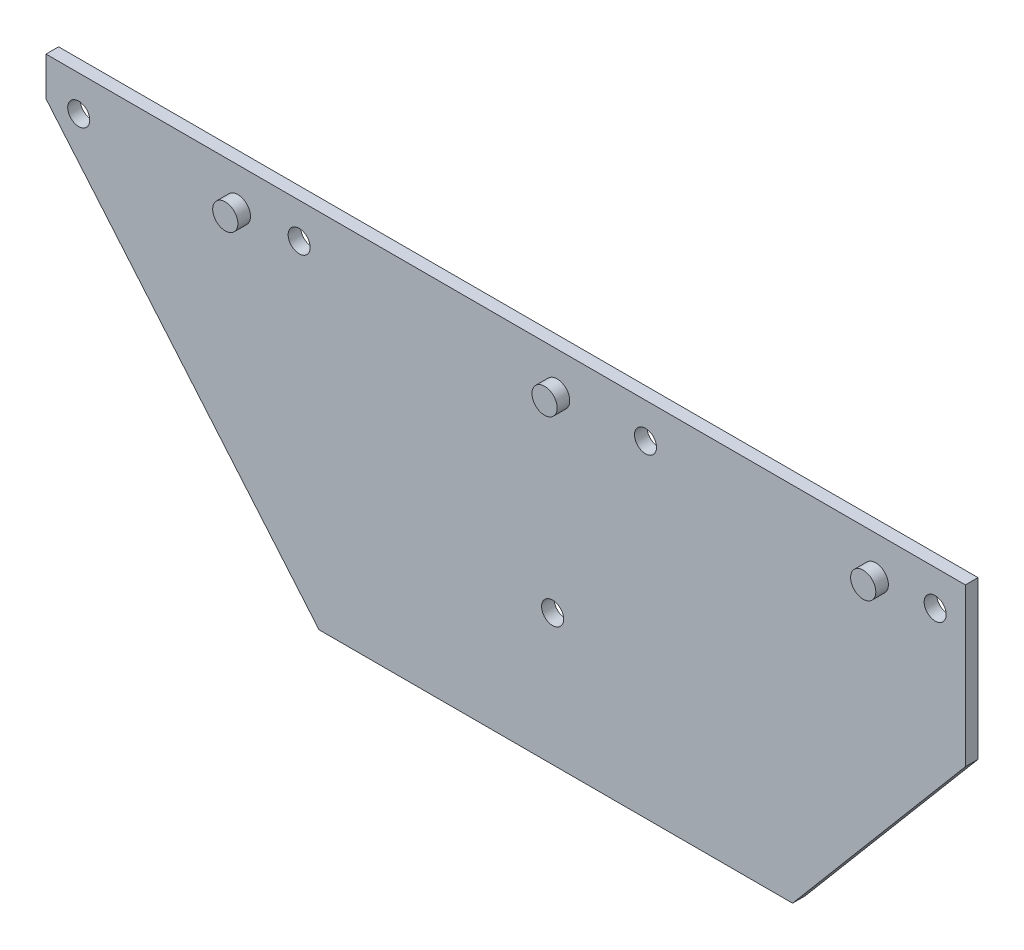
ISO-10303-21;
HEADER;
FILE_DESCRIPTION(('STEP AP214'),'2;1');
FILE_NAME('part.step','',(''),(''),'','','');
FILE_SCHEMA(('AUTOMOTIVE_DESIGN { 1 0 10303 214 1 1 1 1 }'));
ENDSEC;
DATA;
#1=APPLICATION_CONTEXT('core data for automotive mechanical design processes');
#2=APPLICATION_PROTOCOL_DEFINITION('international standard','automotive_design',2000,#1);
#3=PRODUCT_CONTEXT('',#1,'mechanical');
#4=PRODUCT('Part','Part','',(#3));
#5=PRODUCT_RELATED_PRODUCT_CATEGORY('part','',(#4));
#6=PRODUCT_DEFINITION_FORMATION('','',#4);
#7=PRODUCT_DEFINITION_CONTEXT('part definition',#1,'design');
#8=PRODUCT_DEFINITION('design','',#6,#7);
#9=PRODUCT_DEFINITION_SHAPE('','',#8);
#10=(LENGTH_UNIT() NAMED_UNIT(*) SI_UNIT(.MILLI.,.METRE.));
#11=(NAMED_UNIT(*) PLANE_ANGLE_UNIT() SI_UNIT($,.RADIAN.));
#12=(NAMED_UNIT(*) SI_UNIT($,.STERADIAN.) SOLID_ANGLE_UNIT());
#13=UNCERTAINTY_MEASURE_WITH_UNIT(LENGTH_MEASURE(1.E-05),#10,'distance_accuracy_value','');
#14=(GEOMETRIC_REPRESENTATION_CONTEXT(3) GLOBAL_UNCERTAINTY_ASSIGNED_CONTEXT((#13)) GLOBAL_UNIT_ASSIGNED_CONTEXT((#10,
#11,#12)) REPRESENTATION_CONTEXT('',''));
#15=CARTESIAN_POINT('',(0.,0.,0.));
#16=DIRECTION('',(0.,0.,1.));
#17=DIRECTION('',(1.,0.,0.));
#18=AXIS2_PLACEMENT_3D('',#15,#16,#17);
#19=CARTESIAN_POINT('',(0.,0.,2.));
#20=DIRECTION('',(0.,0.,-1.));
#21=DIRECTION('',(-1.,0.,0.));
#22=AXIS2_PLACEMENT_3D('',#19,#20,#21);
#23=PLANE('',#22);
#24=CARTESIAN_POINT('',(58.7699999999999,22.6620282392228,2.));
#25=DIRECTION('',(0.,0.,-1.));
#26=DIRECTION('',(-1.,0.,0.));
#27=AXIS2_PLACEMENT_3D('',#24,#25,#26);
#28=CIRCLE('',#27,2.);
#29=CARTESIAN_POINT('',(56.7699999999999,22.6620282392228,2.));
#30=VERTEX_POINT('',#29);
#31=EDGE_CURVE('E43',#30,#30,#28,.F.);
#32=ORIENTED_EDGE('',*,*,#31,.F.);
#33=EDGE_LOOP('',(#32));
#34=FACE_BOUND('',#33,.T.);
#35=DIRECTION('',(0.,1.,0.));
#36=VECTOR('',#35,1.);
#37=CARTESIAN_POINT('',(72.9999999999999,3.75,2.));
#38=LINE('',#37,#36);
#39=CARTESIAN_POINT('',(72.9999999999999,3.75,2.));
#40=VERTEX_POINT('',#39);
#41=CARTESIAN_POINT('',(72.9999999999999,28.75,2.));
#42=VERTEX_POINT('',#41);
#43=EDGE_CURVE('E131',#40,#42,#38,.T.);
#44=ORIENTED_EDGE('',*,*,#43,.T.);
#45=DIRECTION('',(-1.,0.,0.));
#46=VECTOR('',#45,1.);
#47=CARTESIAN_POINT('',(-73.0000000000001,28.75,2.));
#48=LINE('',#47,#46);
#49=CARTESIAN_POINT('',(-73.0000000000001,28.75,2.));
#50=VERTEX_POINT('',#49);
#51=EDGE_CURVE('E89',#42,#50,#48,.T.);
#52=ORIENTED_EDGE('',*,*,#51,.T.);
#53=DIRECTION('',(0.,-1.,0.));
#54=VECTOR('',#53,1.);
#55=CARTESIAN_POINT('',(-73.,22.5898311404297,2.));
#56=LINE('',#55,#54);
#57=CARTESIAN_POINT('',(-73.,22.5898311404297,2.));
#58=VERTEX_POINT('',#57);
#59=EDGE_CURVE('E102',#50,#58,#56,.T.);
#60=ORIENTED_EDGE('',*,*,#59,.T.);
#61=DIRECTION('',(0.645191033295566,-0.764021289333615,0.));
#62=VECTOR('',#61,1.);
#63=CARTESIAN_POINT('',(-73.,22.5898311404297,2.));
#64=LINE('',#63,#62);
#65=CARTESIAN_POINT('',(-29.645188864299,-28.75,2.));
#66=VERTEX_POINT('',#65);
#67=EDGE_CURVE('E96',#58,#66,#64,.T.);
#68=ORIENTED_EDGE('',*,*,#67,.T.);
#69=DIRECTION('',(1.,0.,0.));
#70=VECTOR('',#69,1.);
#71=CARTESIAN_POINT('',(-29.645188864299,-28.75,2.));
#72=LINE('',#71,#70);
#73=CARTESIAN_POINT('',(45.5548111357011,-28.75,2.));
#74=VERTEX_POINT('',#73);
#75=EDGE_CURVE('E100',#66,#74,#72,.T.);
#76=ORIENTED_EDGE('',*,*,#75,.T.);
#77=DIRECTION('',(0.645191033295572,0.76402128933361,0.));
#78=VECTOR('',#77,1.);
#79=CARTESIAN_POINT('',(72.9999999999999,3.75,2.));
#80=LINE('',#79,#78);
#81=EDGE_CURVE('E51',#74,#40,#80,.T.);
#82=ORIENTED_EDGE('',*,*,#81,.T.);
#83=EDGE_LOOP('',(#44,#52,#60,#68,#76,#82));
#84=FACE_BOUND('',#83,.T.);
#85=CARTESIAN_POINT('',(22.1999999999999,23.13,2.));
#86=DIRECTION('',(0.,0.,1.));
#87=DIRECTION('',(1.,0.,0.));
#88=AXIS2_PLACEMENT_3D('',#85,#86,#87);
#89=CIRCLE('',#88,1.75);
#90=CARTESIAN_POINT('',(23.9499999999999,23.13,2.));
#91=VERTEX_POINT('',#90);
#92=EDGE_CURVE('E124',#91,#91,#89,.T.);
#93=ORIENTED_EDGE('',*,*,#92,.F.);
#94=EDGE_LOOP('',(#93));
#95=FACE_BOUND('',#94,.T.);
#96=CARTESIAN_POINT('',(68.1999999999999,23.13,2.));
#97=DIRECTION('',(0.,0.,1.));
#98=DIRECTION('',(1.,0.,0.));
#99=AXIS2_PLACEMENT_3D('',#96,#97,#98);
#100=CIRCLE('',#99,1.75);
#101=CARTESIAN_POINT('',(69.9499999999999,23.13,2.));
#102=VERTEX_POINT('',#101);
#103=EDGE_CURVE('E186',#102,#102,#100,.T.);
#104=ORIENTED_EDGE('',*,*,#103,.F.);
#105=EDGE_LOOP('',(#104));
#106=FACE_BOUND('',#105,.T.);
#107=CARTESIAN_POINT('',(-32.8000000000001,23.13,2.));
#108=DIRECTION('',(0.,0.,1.));
#109=DIRECTION('',(1.,0.,0.));
#110=AXIS2_PLACEMENT_3D('',#107,#108,#109);
#111=CIRCLE('',#110,1.75);
#112=CARTESIAN_POINT('',(-31.0500000000001,23.13,2.));
#113=VERTEX_POINT('',#112);
#114=EDGE_CURVE('E192',#113,#113,#111,.T.);
#115=ORIENTED_EDGE('',*,*,#114,.F.);
#116=EDGE_LOOP('',(#115));
#117=FACE_BOUND('',#116,.T.);
#118=CARTESIAN_POINT('',(-67.8000000000001,23.13,2.));
#119=DIRECTION('',(0.,0.,1.));
#120=DIRECTION('',(1.,0.,0.));
#121=AXIS2_PLACEMENT_3D('',#118,#119,#120);
#122=CIRCLE('',#121,1.75);
#123=CARTESIAN_POINT('',(-66.0500000000001,23.13,2.));
#124=VERTEX_POINT('',#123);
#125=EDGE_CURVE('E198',#124,#124,#122,.T.);
#126=ORIENTED_EDGE('',*,*,#125,.F.);
#127=EDGE_LOOP('',(#126));
#128=FACE_BOUND('',#127,.T.);
#129=CARTESIAN_POINT('',(7.44999999999993,-7.86999999999999,2.));
#130=DIRECTION('',(0.,0.,1.));
#131=DIRECTION('',(1.,0.,0.));
#132=AXIS2_PLACEMENT_3D('',#129,#130,#131);
#133=CIRCLE('',#132,1.75);
#134=CARTESIAN_POINT('',(9.19999999999994,-7.86999999999999,2.));
#135=VERTEX_POINT('',#134);
#136=EDGE_CURVE('E204',#135,#135,#133,.T.);
#137=ORIENTED_EDGE('',*,*,#136,.F.);
#138=EDGE_LOOP('',(#137));
#139=FACE_BOUND('',#138,.T.);
#140=CARTESIAN_POINT('',(8.16999999999995,22.6620282392228,2.));
#141=DIRECTION('',(0.,0.,-1.));
#142=DIRECTION('',(-1.,0.,0.));
#143=AXIS2_PLACEMENT_3D('',#140,#141,#142);
#144=CIRCLE('',#143,2.);
#145=CARTESIAN_POINT('',(6.16999999999995,22.6620282392228,2.));
#146=VERTEX_POINT('',#145);
#147=EDGE_CURVE('E140',#146,#146,#144,.F.);
#148=ORIENTED_EDGE('',*,*,#147,.F.);
#149=EDGE_LOOP('',(#148));
#150=FACE_BOUND('',#149,.T.);
#151=CARTESIAN_POINT('',(-42.5300000000001,22.6620282392228,2.));
#152=DIRECTION('',(0.,0.,-1.));
#153=DIRECTION('',(-1.,0.,0.));
#154=AXIS2_PLACEMENT_3D('',#151,#152,#153);
#155=CIRCLE('',#154,2.);
#156=CARTESIAN_POINT('',(-44.5300000000001,22.6620282392228,2.));
#157=VERTEX_POINT('',#156);
#158=EDGE_CURVE('E11',#157,#157,#155,.F.);
#159=ORIENTED_EDGE('',*,*,#158,.F.);
#160=EDGE_LOOP('',(#159));
#161=FACE_BOUND('',#160,.T.);
#162=ADVANCED_FACE('F34',(#34,#84,#95,#106,#117,#128,#139,#150,#161),#23,.F.);
#163=CARTESIAN_POINT('',(72.9999999999999,3.75,2.));
#164=DIRECTION('',(-1.,0.,0.));
#165=DIRECTION('',(0.,0.,1.));
#166=AXIS2_PLACEMENT_3D('',#163,#164,#165);
#167=PLANE('',#166);
#168=DIRECTION('',(0.,1.,0.));
#169=VECTOR('',#168,1.);
#170=CARTESIAN_POINT('',(72.9999999999999,3.75,0.));
#171=LINE('',#170,#169);
#172=CARTESIAN_POINT('',(72.9999999999999,3.75,0.));
#173=VERTEX_POINT('',#172);
#174=CARTESIAN_POINT('',(72.9999999999999,28.75,0.));
#175=VERTEX_POINT('',#174);
#176=EDGE_CURVE('E120',#173,#175,#171,.T.);
#177=ORIENTED_EDGE('',*,*,#176,.T.);
#178=DIRECTION('',(0.,0.,-1.));
#179=VECTOR('',#178,1.);
#180=CARTESIAN_POINT('',(72.9999999999999,28.75,2.));
#181=LINE('',#180,#179);
#182=EDGE_CURVE('E138',#42,#175,#181,.T.);
#183=ORIENTED_EDGE('',*,*,#182,.F.);
#184=ORIENTED_EDGE('',*,*,#43,.F.);
#185=DIRECTION('',(0.,0.,-1.));
#186=VECTOR('',#185,1.);
#187=CARTESIAN_POINT('',(72.9999999999999,3.75,2.));
#188=LINE('',#187,#186);
#189=EDGE_CURVE('E116',#40,#173,#188,.T.);
#190=ORIENTED_EDGE('',*,*,#189,.T.);
#191=EDGE_LOOP('',(#177,#183,#184,#190));
#192=FACE_BOUND('',#191,.T.);
#193=ADVANCED_FACE('F36',(#192),#167,.F.);
#194=CARTESIAN_POINT('',(-73.0000000000001,28.75,2.));
#195=DIRECTION('',(0.,-1.,0.));
#196=DIRECTION('',(0.,0.,-1.));
#197=AXIS2_PLACEMENT_3D('',#194,#195,#196);
#198=PLANE('',#197);
#199=DIRECTION('',(-1.,0.,0.));
#200=VECTOR('',#199,1.);
#201=CARTESIAN_POINT('',(-73.0000000000001,28.75,0.));
#202=LINE('',#201,#200);
#203=CARTESIAN_POINT('',(-73.0000000000001,28.75,0.));
#204=VERTEX_POINT('',#203);
#205=EDGE_CURVE('E123',#175,#204,#202,.T.);
#206=ORIENTED_EDGE('',*,*,#205,.T.);
#207=DIRECTION('',(0.,0.,-1.));
#208=VECTOR('',#207,1.);
#209=CARTESIAN_POINT('',(-73.0000000000001,28.75,2.));
#210=LINE('',#209,#208);
#211=EDGE_CURVE('E135',#50,#204,#210,.T.);
#212=ORIENTED_EDGE('',*,*,#211,.F.);
#213=ORIENTED_EDGE('',*,*,#51,.F.);
#214=ORIENTED_EDGE('',*,*,#182,.T.);
#215=EDGE_LOOP('',(#206,#212,#213,#214));
#216=FACE_BOUND('',#215,.T.);
#217=ADVANCED_FACE('F152',(#216),#198,.F.);
#218=CARTESIAN_POINT('',(-73.,22.5898311404297,2.));
#219=DIRECTION('',(1.,0.,0.));
#220=DIRECTION('',(0.,1.,0.));
#221=AXIS2_PLACEMENT_3D('',#218,#219,#220);
#222=PLANE('',#221);
#223=DIRECTION('',(0.,-1.,0.));
#224=VECTOR('',#223,1.);
#225=CARTESIAN_POINT('',(-73.,22.5898311404297,0.));
#226=LINE('',#225,#224);
#227=CARTESIAN_POINT('',(-73.,22.5898311404297,0.));
#228=VERTEX_POINT('',#227);
#229=EDGE_CURVE('E126',#204,#228,#226,.T.);
#230=ORIENTED_EDGE('',*,*,#229,.T.);
#231=DIRECTION('',(0.,0.,-1.));
#232=VECTOR('',#231,1.);
#233=CARTESIAN_POINT('',(-73.,22.5898311404297,2.));
#234=LINE('',#233,#232);
#235=EDGE_CURVE('E111',#58,#228,#234,.T.);
#236=ORIENTED_EDGE('',*,*,#235,.F.);
#237=ORIENTED_EDGE('',*,*,#59,.F.);
#238=ORIENTED_EDGE('',*,*,#211,.T.);
#239=EDGE_LOOP('',(#230,#236,#237,#238));
#240=FACE_BOUND('',#239,.T.);
#241=ADVANCED_FACE('F169',(#240),#222,.F.);
#242=CARTESIAN_POINT('',(-73.,22.5898311404297,2.));
#243=DIRECTION('',(0.764021289333615,0.645191033295566,0.));
#244=DIRECTION('',(-0.645191033295566,0.764021289333615,0.));
#245=AXIS2_PLACEMENT_3D('',#242,#243,#244);
#246=PLANE('',#245);
#247=DIRECTION('',(0.645191033295566,-0.764021289333615,0.));
#248=VECTOR('',#247,1.);
#249=CARTESIAN_POINT('',(-73.,22.5898311404297,0.));
#250=LINE('',#249,#248);
#251=CARTESIAN_POINT('',(-29.645188864299,-28.75,0.));
#252=VERTEX_POINT('',#251);
#253=EDGE_CURVE('E110',#228,#252,#250,.T.);
#254=ORIENTED_EDGE('',*,*,#253,.T.);
#255=DIRECTION('',(0.,0.,-1.));
#256=VECTOR('',#255,1.);
#257=CARTESIAN_POINT('',(-29.645188864299,-28.75,2.));
#258=LINE('',#257,#256);
#259=EDGE_CURVE('E107',#66,#252,#258,.T.);
#260=ORIENTED_EDGE('',*,*,#259,.F.);
#261=ORIENTED_EDGE('',*,*,#67,.F.);
#262=ORIENTED_EDGE('',*,*,#235,.T.);
#263=EDGE_LOOP('',(#254,#260,#261,#262));
#264=FACE_BOUND('',#263,.T.);
#265=ADVANCED_FACE('F108',(#264),#246,.F.);
#266=CARTESIAN_POINT('',(-29.645188864299,-28.75,2.));
#267=DIRECTION('',(0.,1.,0.));
#268=DIRECTION('',(-1.,0.,0.));
#269=AXIS2_PLACEMENT_3D('',#266,#267,#268);
#270=PLANE('',#269);
#271=DIRECTION('',(1.,0.,0.));
#272=VECTOR('',#271,1.);
#273=CARTESIAN_POINT('',(-29.645188864299,-28.75,0.));
#274=LINE('',#273,#272);
#275=CARTESIAN_POINT('',(45.5548111357011,-28.75,0.));
#276=VERTEX_POINT('',#275);
#277=EDGE_CURVE('E74',#252,#276,#274,.T.);
#278=ORIENTED_EDGE('',*,*,#277,.T.);
#279=DIRECTION('',(0.,0.,-1.));
#280=VECTOR('',#279,1.);
#281=CARTESIAN_POINT('',(45.5548111357011,-28.75,2.));
#282=LINE('',#281,#280);
#283=EDGE_CURVE('E112',#74,#276,#282,.T.);
#284=ORIENTED_EDGE('',*,*,#283,.F.);
#285=ORIENTED_EDGE('',*,*,#75,.F.);
#286=ORIENTED_EDGE('',*,*,#259,.T.);
#287=EDGE_LOOP('',(#278,#284,#285,#286));
#288=FACE_BOUND('',#287,.T.);
#289=ADVANCED_FACE('F114',(#288),#270,.F.);
#290=CARTESIAN_POINT('',(72.9999999999999,3.75,2.));
#291=DIRECTION('',(-0.76402128933361,0.645191033295572,0.));
#292=DIRECTION('',(-0.645191033295572,-0.764021289333611,0.));
#293=AXIS2_PLACEMENT_3D('',#290,#291,#292);
#294=PLANE('',#293);
#295=DIRECTION('',(0.645191033295572,0.76402128933361,0.));
#296=VECTOR('',#295,1.);
#297=CARTESIAN_POINT('',(72.9999999999999,3.75,0.));
#298=LINE('',#297,#296);
#299=EDGE_CURVE('E80',#276,#173,#298,.T.);
#300=ORIENTED_EDGE('',*,*,#299,.T.);
#301=ORIENTED_EDGE('',*,*,#189,.F.);
#302=ORIENTED_EDGE('',*,*,#81,.F.);
#303=ORIENTED_EDGE('',*,*,#283,.T.);
#304=EDGE_LOOP('',(#300,#301,#302,#303));
#305=FACE_BOUND('',#304,.T.);
#306=ADVANCED_FACE('F161',(#305),#294,.F.);
#307=CARTESIAN_POINT('',(0.,0.,0.));
#308=DIRECTION('',(0.,0.,-1.));
#309=DIRECTION('',(-1.,0.,0.));
#310=AXIS2_PLACEMENT_3D('',#307,#308,#309);
#311=PLANE('',#310);
#312=CARTESIAN_POINT('',(7.44999999999993,-7.86999999999999,0.));
#313=DIRECTION('',(0.,0.,-1.));
#314=DIRECTION('',(-1.,0.,0.));
#315=AXIS2_PLACEMENT_3D('',#312,#313,#314);
#316=CIRCLE('',#315,1.75);
#317=CARTESIAN_POINT('',(5.69999999999993,-7.86999999999999,0.));
#318=VERTEX_POINT('',#317);
#319=EDGE_CURVE('E207',#318,#318,#316,.F.);
#320=ORIENTED_EDGE('',*,*,#319,.T.);
#321=EDGE_LOOP('',(#320));
#322=FACE_BOUND('',#321,.T.);
#323=CARTESIAN_POINT('',(-67.8000000000001,23.13,0.));
#324=DIRECTION('',(0.,0.,-1.));
#325=DIRECTION('',(-1.,0.,0.));
#326=AXIS2_PLACEMENT_3D('',#323,#324,#325);
#327=CIRCLE('',#326,1.75);
#328=CARTESIAN_POINT('',(-69.5500000000001,23.13,0.));
#329=VERTEX_POINT('',#328);
#330=EDGE_CURVE('E201',#329,#329,#327,.F.);
#331=ORIENTED_EDGE('',*,*,#330,.T.);
#332=EDGE_LOOP('',(#331));
#333=FACE_BOUND('',#332,.T.);
#334=CARTESIAN_POINT('',(-32.8000000000001,23.13,0.));
#335=DIRECTION('',(0.,0.,-1.));
#336=DIRECTION('',(-1.,0.,0.));
#337=AXIS2_PLACEMENT_3D('',#334,#335,#336);
#338=CIRCLE('',#337,1.75);
#339=CARTESIAN_POINT('',(-34.5500000000001,23.13,0.));
#340=VERTEX_POINT('',#339);
#341=EDGE_CURVE('E195',#340,#340,#338,.F.);
#342=ORIENTED_EDGE('',*,*,#341,.T.);
#343=EDGE_LOOP('',(#342));
#344=FACE_BOUND('',#343,.T.);
#345=CARTESIAN_POINT('',(68.1999999999999,23.13,0.));
#346=DIRECTION('',(0.,0.,-1.));
#347=DIRECTION('',(-1.,0.,0.));
#348=AXIS2_PLACEMENT_3D('',#345,#346,#347);
#349=CIRCLE('',#348,1.75);
#350=CARTESIAN_POINT('',(66.4499999999999,23.13,0.));
#351=VERTEX_POINT('',#350);
#352=EDGE_CURVE('E189',#351,#351,#349,.F.);
#353=ORIENTED_EDGE('',*,*,#352,.T.);
#354=EDGE_LOOP('',(#353));
#355=FACE_BOUND('',#354,.T.);
#356=CARTESIAN_POINT('',(22.1999999999999,23.13,0.));
#357=DIRECTION('',(0.,0.,-1.));
#358=DIRECTION('',(-1.,0.,0.));
#359=AXIS2_PLACEMENT_3D('',#356,#357,#358);
#360=CIRCLE('',#359,1.75);
#361=CARTESIAN_POINT('',(20.4499999999999,23.13,0.));
#362=VERTEX_POINT('',#361);
#363=EDGE_CURVE('E183',#362,#362,#360,.F.);
#364=ORIENTED_EDGE('',*,*,#363,.T.);
#365=EDGE_LOOP('',(#364));
#366=FACE_BOUND('',#365,.T.);
#367=ORIENTED_EDGE('',*,*,#176,.F.);
#368=ORIENTED_EDGE('',*,*,#299,.F.);
#369=ORIENTED_EDGE('',*,*,#277,.F.);
#370=ORIENTED_EDGE('',*,*,#253,.F.);
#371=ORIENTED_EDGE('',*,*,#229,.F.);
#372=ORIENTED_EDGE('',*,*,#205,.F.);
#373=EDGE_LOOP('',(#367,#368,#369,#370,#371,#372));
#374=FACE_BOUND('',#373,.T.);
#375=ADVANCED_FACE('F158',(#322,#333,#344,#355,#366,#374),#311,.T.);
#376=CARTESIAN_POINT('',(22.1999999999999,23.13,-0.00100000000000013));
#377=DIRECTION('',(0.,0.,1.));
#378=DIRECTION('',(1.,0.,0.));
#379=AXIS2_PLACEMENT_3D('',#376,#377,#378);
#380=CYLINDRICAL_SURFACE('',#379,1.75);
#381=ORIENTED_EDGE('',*,*,#363,.F.);
#382=EDGE_LOOP('',(#381));
#383=FACE_BOUND('',#382,.T.);
#384=ORIENTED_EDGE('',*,*,#92,.T.);
#385=EDGE_LOOP('',(#384));
#386=FACE_BOUND('',#385,.T.);
#387=ADVANCED_FACE('F156',(#383,#386),#380,.F.);
#388=CARTESIAN_POINT('',(68.1999999999999,23.13,-0.00100000000000013));
#389=DIRECTION('',(0.,0.,1.));
#390=DIRECTION('',(1.,0.,0.));
#391=AXIS2_PLACEMENT_3D('',#388,#389,#390);
#392=CYLINDRICAL_SURFACE('',#391,1.75);
#393=ORIENTED_EDGE('',*,*,#352,.F.);
#394=EDGE_LOOP('',(#393));
#395=FACE_BOUND('',#394,.T.);
#396=ORIENTED_EDGE('',*,*,#103,.T.);
#397=EDGE_LOOP('',(#396));
#398=FACE_BOUND('',#397,.T.);
#399=ADVANCED_FACE('F260',(#395,#398),#392,.F.);
#400=CARTESIAN_POINT('',(-32.8000000000001,23.13,-0.00100000000000013));
#401=DIRECTION('',(0.,0.,1.));
#402=DIRECTION('',(1.,0.,0.));
#403=AXIS2_PLACEMENT_3D('',#400,#401,#402);
#404=CYLINDRICAL_SURFACE('',#403,1.75);
#405=ORIENTED_EDGE('',*,*,#341,.F.);
#406=EDGE_LOOP('',(#405));
#407=FACE_BOUND('',#406,.T.);
#408=ORIENTED_EDGE('',*,*,#114,.T.);
#409=EDGE_LOOP('',(#408));
#410=FACE_BOUND('',#409,.T.);
#411=ADVANCED_FACE('F257',(#407,#410),#404,.F.);
#412=CARTESIAN_POINT('',(-67.8000000000001,23.13,-0.00100000000000013));
#413=DIRECTION('',(0.,0.,1.));
#414=DIRECTION('',(1.,0.,0.));
#415=AXIS2_PLACEMENT_3D('',#412,#413,#414);
#416=CYLINDRICAL_SURFACE('',#415,1.75);
#417=ORIENTED_EDGE('',*,*,#330,.F.);
#418=EDGE_LOOP('',(#417));
#419=FACE_BOUND('',#418,.T.);
#420=ORIENTED_EDGE('',*,*,#125,.T.);
#421=EDGE_LOOP('',(#420));
#422=FACE_BOUND('',#421,.T.);
#423=ADVANCED_FACE('F253',(#419,#422),#416,.F.);
#424=CARTESIAN_POINT('',(7.44999999999993,-7.86999999999999,-0.00100000000000013));
#425=DIRECTION('',(0.,0.,1.));
#426=DIRECTION('',(1.,0.,0.));
#427=AXIS2_PLACEMENT_3D('',#424,#425,#426);
#428=CYLINDRICAL_SURFACE('',#427,1.75);
#429=ORIENTED_EDGE('',*,*,#319,.F.);
#430=EDGE_LOOP('',(#429));
#431=FACE_BOUND('',#430,.T.);
#432=ORIENTED_EDGE('',*,*,#136,.T.);
#433=EDGE_LOOP('',(#432));
#434=FACE_BOUND('',#433,.T.);
#435=ADVANCED_FACE('F249',(#431,#434),#428,.F.);
#436=CARTESIAN_POINT('',(8.16999999999995,22.6620282392228,4.));
#437=DIRECTION('',(0.,0.,-1.));
#438=DIRECTION('',(-1.,0.,0.));
#439=AXIS2_PLACEMENT_3D('',#436,#437,#438);
#440=CYLINDRICAL_SURFACE('',#439,2.);
#441=CARTESIAN_POINT('',(8.16999999999995,22.6620282392228,4.));
#442=DIRECTION('',(0.,0.,1.));
#443=DIRECTION('',(1.,0.,0.));
#444=AXIS2_PLACEMENT_3D('',#441,#442,#443);
#445=CIRCLE('',#444,2.);
#446=CARTESIAN_POINT('',(10.17,22.6620282392228,4.));
#447=VERTEX_POINT('',#446);
#448=EDGE_CURVE('E210',#447,#447,#445,.T.);
#449=ORIENTED_EDGE('',*,*,#448,.F.);
#450=EDGE_LOOP('',(#449));
#451=FACE_BOUND('',#450,.T.);
#452=ORIENTED_EDGE('',*,*,#147,.T.);
#453=EDGE_LOOP('',(#452));
#454=FACE_BOUND('',#453,.T.);
#455=ADVANCED_FACE('F245',(#451,#454),#440,.T.);
#456=CARTESIAN_POINT('',(8.16999999999995,22.6620282392228,4.));
#457=DIRECTION('',(0.,0.,1.));
#458=DIRECTION('',(1.,0.,0.));
#459=AXIS2_PLACEMENT_3D('',#456,#457,#458);
#460=PLANE('',#459);
#461=ORIENTED_EDGE('',*,*,#448,.T.);
#462=EDGE_LOOP('',(#461));
#463=FACE_BOUND('',#462,.T.);
#464=ADVANCED_FACE('F241',(#463),#460,.T.);
#465=CARTESIAN_POINT('',(58.7699999999999,22.6620282392228,4.));
#466=DIRECTION('',(0.,0.,-1.));
#467=DIRECTION('',(-1.,0.,0.));
#468=AXIS2_PLACEMENT_3D('',#465,#466,#467);
#469=CYLINDRICAL_SURFACE('',#468,2.);
#470=CARTESIAN_POINT('',(58.7699999999999,22.6620282392228,4.));
#471=DIRECTION('',(0.,0.,1.));
#472=DIRECTION('',(1.,0.,0.));
#473=AXIS2_PLACEMENT_3D('',#470,#471,#472);
#474=CIRCLE('',#473,2.);
#475=CARTESIAN_POINT('',(60.7699999999999,22.6620282392228,4.));
#476=VERTEX_POINT('',#475);
#477=EDGE_CURVE('E215',#476,#476,#474,.T.);
#478=ORIENTED_EDGE('',*,*,#477,.F.);
#479=EDGE_LOOP('',(#478));
#480=FACE_BOUND('',#479,.T.);
#481=ORIENTED_EDGE('',*,*,#31,.T.);
#482=EDGE_LOOP('',(#481));
#483=FACE_BOUND('',#482,.T.);
#484=ADVANCED_FACE('F145',(#480,#483),#469,.T.);
#485=CARTESIAN_POINT('',(58.7699999999999,22.6620282392228,4.));
#486=DIRECTION('',(0.,0.,1.));
#487=DIRECTION('',(1.,0.,0.));
#488=AXIS2_PLACEMENT_3D('',#485,#486,#487);
#489=PLANE('',#488);
#490=ORIENTED_EDGE('',*,*,#477,.T.);
#491=EDGE_LOOP('',(#490));
#492=FACE_BOUND('',#491,.T.);
#493=ADVANCED_FACE('F227',(#492),#489,.T.);
#494=CARTESIAN_POINT('',(-42.5300000000001,22.6620282392228,4.));
#495=DIRECTION('',(0.,0.,-1.));
#496=DIRECTION('',(-1.,0.,0.));
#497=AXIS2_PLACEMENT_3D('',#494,#495,#496);
#498=CYLINDRICAL_SURFACE('',#497,2.);
#499=CARTESIAN_POINT('',(-42.5300000000001,22.6620282392228,4.));
#500=DIRECTION('',(0.,0.,1.));
#501=DIRECTION('',(1.,0.,0.));
#502=AXIS2_PLACEMENT_3D('',#499,#500,#501);
#503=CIRCLE('',#502,2.);
#504=CARTESIAN_POINT('',(-40.5300000000001,22.6620282392228,4.));
#505=VERTEX_POINT('',#504);
#506=EDGE_CURVE('E218',#505,#505,#503,.T.);
#507=ORIENTED_EDGE('',*,*,#506,.F.);
#508=EDGE_LOOP('',(#507));
#509=FACE_BOUND('',#508,.T.);
#510=ORIENTED_EDGE('',*,*,#158,.T.);
#511=EDGE_LOOP('',(#510));
#512=FACE_BOUND('',#511,.T.);
#513=ADVANCED_FACE('F224',(#509,#512),#498,.T.);
#514=CARTESIAN_POINT('',(-42.5300000000001,22.6620282392228,4.));
#515=DIRECTION('',(0.,0.,1.));
#516=DIRECTION('',(1.,0.,0.));
#517=AXIS2_PLACEMENT_3D('',#514,#515,#516);
#518=PLANE('',#517);
#519=ORIENTED_EDGE('',*,*,#506,.T.);
#520=EDGE_LOOP('',(#519));
#521=FACE_BOUND('',#520,.T.);
#522=ADVANCED_FACE('F222',(#521),#518,.T.);
#523=CLOSED_SHELL('',(#162,#193,#217,#241,#265,#289,#306,#375,#387,#399,#411,#423,#435,#455,
#464,#484,#493,#513,#522));
#524=MANIFOLD_SOLID_BREP('B2',#523);
#525=ADVANCED_BREP_SHAPE_REPRESENTATION('',(#18,#524),#14);
#526=SHAPE_DEFINITION_REPRESENTATION(#9,#525);
ENDSEC;
END-ISO-10303-21;
